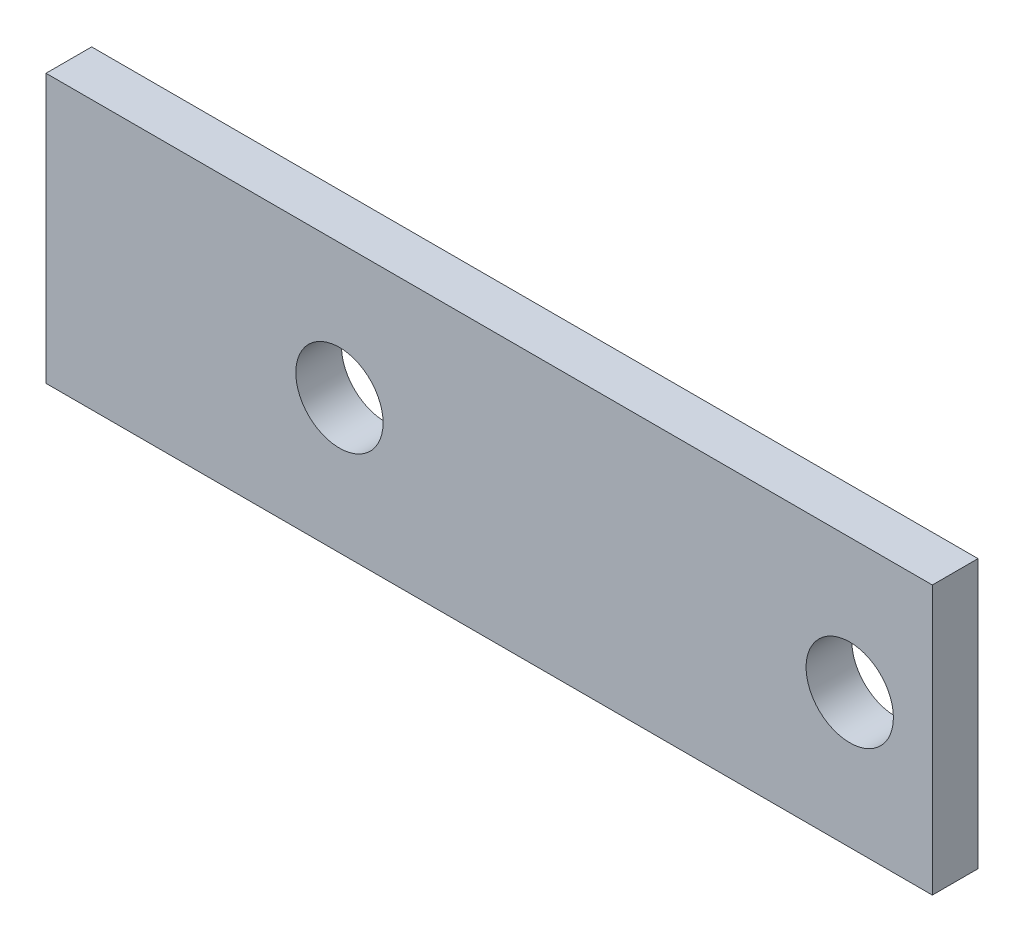
ISO-10303-21;
HEADER;
FILE_DESCRIPTION(('STEP AP214'),'2;1');
FILE_NAME('part.step','',(''),(''),'','','');
FILE_SCHEMA(('AUTOMOTIVE_DESIGN { 1 0 10303 214 1 1 1 1 }'));
ENDSEC;
DATA;
#1=APPLICATION_CONTEXT('core data for automotive mechanical design processes');
#2=APPLICATION_PROTOCOL_DEFINITION('international standard','automotive_design',2000,#1);
#3=PRODUCT_CONTEXT('',#1,'mechanical');
#4=PRODUCT('Part','Part','',(#3));
#5=PRODUCT_RELATED_PRODUCT_CATEGORY('part','',(#4));
#6=PRODUCT_DEFINITION_FORMATION('','',#4);
#7=PRODUCT_DEFINITION_CONTEXT('part definition',#1,'design');
#8=PRODUCT_DEFINITION('design','',#6,#7);
#9=PRODUCT_DEFINITION_SHAPE('','',#8);
#10=(LENGTH_UNIT() NAMED_UNIT(*) SI_UNIT(.MILLI.,.METRE.));
#11=(NAMED_UNIT(*) PLANE_ANGLE_UNIT() SI_UNIT($,.RADIAN.));
#12=(NAMED_UNIT(*) SI_UNIT($,.STERADIAN.) SOLID_ANGLE_UNIT());
#13=UNCERTAINTY_MEASURE_WITH_UNIT(LENGTH_MEASURE(1.E-05),#10,'distance_accuracy_value','');
#14=(GEOMETRIC_REPRESENTATION_CONTEXT(3) GLOBAL_UNCERTAINTY_ASSIGNED_CONTEXT((#13)) GLOBAL_UNIT_ASSIGNED_CONTEXT((#10,
#11,#12)) REPRESENTATION_CONTEXT('',''));
#15=CARTESIAN_POINT('',(0.,0.,0.));
#16=DIRECTION('',(0.,0.,1.));
#17=DIRECTION('',(1.,0.,0.));
#18=AXIS2_PLACEMENT_3D('',#15,#16,#17);
#19=CARTESIAN_POINT('',(16.5,5.,1.7));
#20=DIRECTION('',(-1.,0.,0.));
#21=DIRECTION('',(0.,0.,1.));
#22=AXIS2_PLACEMENT_3D('',#19,#20,#21);
#23=PLANE('',#22);
#24=DIRECTION('',(0.,1.,0.));
#25=VECTOR('',#24,1.);
#26=CARTESIAN_POINT('',(16.5,5.,0.));
#27=LINE('',#26,#25);
#28=CARTESIAN_POINT('',(16.5,-5.,0.));
#29=VERTEX_POINT('',#28);
#30=CARTESIAN_POINT('',(16.5,5.,0.));
#31=VERTEX_POINT('',#30);
#32=EDGE_CURVE('E97',#29,#31,#27,.T.);
#33=ORIENTED_EDGE('',*,*,#32,.T.);
#34=DIRECTION('',(0.,0.,-1.));
#35=VECTOR('',#34,1.);
#36=CARTESIAN_POINT('',(16.5,5.,1.7));
#37=LINE('',#36,#35);
#38=CARTESIAN_POINT('',(16.5,5.,1.7));
#39=VERTEX_POINT('',#38);
#40=EDGE_CURVE('E11',#39,#31,#37,.T.);
#41=ORIENTED_EDGE('',*,*,#40,.F.);
#42=DIRECTION('',(0.,1.,0.));
#43=VECTOR('',#42,1.);
#44=CARTESIAN_POINT('',(16.5,5.,1.7));
#45=LINE('',#44,#43);
#46=CARTESIAN_POINT('',(16.5,-5.,1.7));
#47=VERTEX_POINT('',#46);
#48=EDGE_CURVE('E85',#47,#39,#45,.T.);
#49=ORIENTED_EDGE('',*,*,#48,.F.);
#50=DIRECTION('',(0.,0.,-1.));
#51=VECTOR('',#50,1.);
#52=CARTESIAN_POINT('',(16.5,-5.,1.7));
#53=LINE('',#52,#51);
#54=EDGE_CURVE('E93',#47,#29,#53,.T.);
#55=ORIENTED_EDGE('',*,*,#54,.T.);
#56=EDGE_LOOP('',(#33,#41,#49,#55));
#57=FACE_BOUND('',#56,.T.);
#58=ADVANCED_FACE('F34',(#57),#23,.F.);
#59=CARTESIAN_POINT('',(-16.5,5.,1.7));
#60=DIRECTION('',(0.,-1.,0.));
#61=DIRECTION('',(0.,0.,-1.));
#62=AXIS2_PLACEMENT_3D('',#59,#60,#61);
#63=PLANE('',#62);
#64=DIRECTION('',(-1.,0.,0.));
#65=VECTOR('',#64,1.);
#66=CARTESIAN_POINT('',(-16.5,5.,0.));
#67=LINE('',#66,#65);
#68=CARTESIAN_POINT('',(-16.5,5.,0.));
#69=VERTEX_POINT('',#68);
#70=EDGE_CURVE('E89',#31,#69,#67,.T.);
#71=ORIENTED_EDGE('',*,*,#70,.T.);
#72=DIRECTION('',(0.,0.,-1.));
#73=VECTOR('',#72,1.);
#74=CARTESIAN_POINT('',(-16.5,5.,1.7));
#75=LINE('',#74,#73);
#76=CARTESIAN_POINT('',(-16.5,5.,1.7));
#77=VERTEX_POINT('',#76);
#78=EDGE_CURVE('E42',#77,#69,#75,.T.);
#79=ORIENTED_EDGE('',*,*,#78,.F.);
#80=DIRECTION('',(-1.,0.,0.));
#81=VECTOR('',#80,1.);
#82=CARTESIAN_POINT('',(-16.5,5.,1.7));
#83=LINE('',#82,#81);
#84=EDGE_CURVE('E80',#39,#77,#83,.T.);
#85=ORIENTED_EDGE('',*,*,#84,.F.);
#86=ORIENTED_EDGE('',*,*,#40,.T.);
#87=EDGE_LOOP('',(#71,#79,#85,#86));
#88=FACE_BOUND('',#87,.T.);
#89=ADVANCED_FACE('F88',(#88),#63,.F.);
#90=CARTESIAN_POINT('',(-16.5,5.,1.7));
#91=DIRECTION('',(1.,0.,0.));
#92=DIRECTION('',(0.,0.,-1.));
#93=AXIS2_PLACEMENT_3D('',#90,#91,#92);
#94=PLANE('',#93);
#95=DIRECTION('',(0.,-1.,0.));
#96=VECTOR('',#95,1.);
#97=CARTESIAN_POINT('',(-16.5,5.,0.));
#98=LINE('',#97,#96);
#99=CARTESIAN_POINT('',(-16.5,-5.,0.));
#100=VERTEX_POINT('',#99);
#101=EDGE_CURVE('E67',#69,#100,#98,.T.);
#102=ORIENTED_EDGE('',*,*,#101,.T.);
#103=DIRECTION('',(0.,0.,-1.));
#104=VECTOR('',#103,1.);
#105=CARTESIAN_POINT('',(-16.5,-5.,1.7));
#106=LINE('',#105,#104);
#107=CARTESIAN_POINT('',(-16.5,-5.,1.7));
#108=VERTEX_POINT('',#107);
#109=EDGE_CURVE('E90',#108,#100,#106,.T.);
#110=ORIENTED_EDGE('',*,*,#109,.F.);
#111=DIRECTION('',(0.,-1.,0.));
#112=VECTOR('',#111,1.);
#113=CARTESIAN_POINT('',(-16.5,5.,1.7));
#114=LINE('',#113,#112);
#115=EDGE_CURVE('E83',#77,#108,#114,.T.);
#116=ORIENTED_EDGE('',*,*,#115,.F.);
#117=ORIENTED_EDGE('',*,*,#78,.T.);
#118=EDGE_LOOP('',(#102,#110,#116,#117));
#119=FACE_BOUND('',#118,.T.);
#120=ADVANCED_FACE('F91',(#119),#94,.F.);
#121=CARTESIAN_POINT('',(-16.5,-5.,1.7));
#122=DIRECTION('',(0.,1.,0.));
#123=DIRECTION('',(0.,0.,1.));
#124=AXIS2_PLACEMENT_3D('',#121,#122,#123);
#125=PLANE('',#124);
#126=DIRECTION('',(1.,0.,0.));
#127=VECTOR('',#126,1.);
#128=CARTESIAN_POINT('',(-16.5,-5.,0.));
#129=LINE('',#128,#127);
#130=EDGE_CURVE('E73',#100,#29,#129,.T.);
#131=ORIENTED_EDGE('',*,*,#130,.T.);
#132=ORIENTED_EDGE('',*,*,#54,.F.);
#133=DIRECTION('',(1.,0.,0.));
#134=VECTOR('',#133,1.);
#135=CARTESIAN_POINT('',(-16.5,-5.,1.7));
#136=LINE('',#135,#134);
#137=EDGE_CURVE('E50',#108,#47,#136,.T.);
#138=ORIENTED_EDGE('',*,*,#137,.F.);
#139=ORIENTED_EDGE('',*,*,#109,.T.);
#140=EDGE_LOOP('',(#131,#132,#138,#139));
#141=FACE_BOUND('',#140,.T.);
#142=ADVANCED_FACE('F105',(#141),#125,.F.);
#143=CARTESIAN_POINT('',(0.,0.,1.7));
#144=DIRECTION('',(0.,0.,1.));
#145=DIRECTION('',(1.,0.,0.));
#146=AXIS2_PLACEMENT_3D('',#143,#144,#145);
#147=PLANE('',#146);
#148=CARTESIAN_POINT('',(13.425,0.,1.7));
#149=DIRECTION('',(0.,0.,1.));
#150=DIRECTION('',(1.,0.,0.));
#151=AXIS2_PLACEMENT_3D('',#148,#149,#150);
#152=CIRCLE('',#151,1.625);
#153=CARTESIAN_POINT('',(15.05,0.,1.7));
#154=VERTEX_POINT('',#153);
#155=EDGE_CURVE('E114',#154,#154,#152,.T.);
#156=ORIENTED_EDGE('',*,*,#155,.F.);
#157=EDGE_LOOP('',(#156));
#158=FACE_BOUND('',#157,.T.);
#159=CARTESIAN_POINT('',(-5.575,0.,1.7));
#160=DIRECTION('',(0.,0.,1.));
#161=DIRECTION('',(1.,0.,0.));
#162=AXIS2_PLACEMENT_3D('',#159,#160,#161);
#163=CIRCLE('',#162,1.625);
#164=CARTESIAN_POINT('',(-3.95,0.,1.7));
#165=VERTEX_POINT('',#164);
#166=EDGE_CURVE('E115',#165,#165,#163,.T.);
#167=ORIENTED_EDGE('',*,*,#166,.F.);
#168=EDGE_LOOP('',(#167));
#169=FACE_BOUND('',#168,.T.);
#170=ORIENTED_EDGE('',*,*,#48,.T.);
#171=ORIENTED_EDGE('',*,*,#84,.T.);
#172=ORIENTED_EDGE('',*,*,#115,.T.);
#173=ORIENTED_EDGE('',*,*,#137,.T.);
#174=EDGE_LOOP('',(#170,#171,#172,#173));
#175=FACE_BOUND('',#174,.T.);
#176=ADVANCED_FACE('F81',(#158,#169,#175),#147,.T.);
#177=CARTESIAN_POINT('',(0.,0.,0.));
#178=DIRECTION('',(0.,0.,1.));
#179=DIRECTION('',(1.,0.,0.));
#180=AXIS2_PLACEMENT_3D('',#177,#178,#179);
#181=PLANE('',#180);
#182=CARTESIAN_POINT('',(13.425,0.,0.));
#183=DIRECTION('',(0.,0.,1.));
#184=DIRECTION('',(1.,0.,0.));
#185=AXIS2_PLACEMENT_3D('',#182,#183,#184);
#186=CIRCLE('',#185,1.625);
#187=CARTESIAN_POINT('',(15.05,0.,0.));
#188=VERTEX_POINT('',#187);
#189=EDGE_CURVE('E100',#188,#188,#186,.F.);
#190=ORIENTED_EDGE('',*,*,#189,.F.);
#191=EDGE_LOOP('',(#190));
#192=FACE_BOUND('',#191,.T.);
#193=CARTESIAN_POINT('',(-5.575,0.,0.));
#194=DIRECTION('',(0.,0.,1.));
#195=DIRECTION('',(1.,0.,0.));
#196=AXIS2_PLACEMENT_3D('',#193,#194,#195);
#197=CIRCLE('',#196,1.625);
#198=CARTESIAN_POINT('',(-3.95,0.,0.));
#199=VERTEX_POINT('',#198);
#200=EDGE_CURVE('E111',#199,#199,#197,.F.);
#201=ORIENTED_EDGE('',*,*,#200,.F.);
#202=EDGE_LOOP('',(#201));
#203=FACE_BOUND('',#202,.T.);
#204=ORIENTED_EDGE('',*,*,#32,.F.);
#205=ORIENTED_EDGE('',*,*,#130,.F.);
#206=ORIENTED_EDGE('',*,*,#101,.F.);
#207=ORIENTED_EDGE('',*,*,#70,.F.);
#208=EDGE_LOOP('',(#204,#205,#206,#207));
#209=FACE_BOUND('',#208,.T.);
#210=ADVANCED_FACE('F108',(#192,#203,#209),#181,.F.);
#211=CARTESIAN_POINT('',(-5.575,0.,-4.59619407771256));
#212=DIRECTION('',(0.,0.,1.));
#213=DIRECTION('',(1.,0.,0.));
#214=AXIS2_PLACEMENT_3D('',#211,#212,#213);
#215=CYLINDRICAL_SURFACE('',#214,1.625);
#216=ORIENTED_EDGE('',*,*,#200,.T.);
#217=EDGE_LOOP('',(#216));
#218=FACE_BOUND('',#217,.T.);
#219=ORIENTED_EDGE('',*,*,#166,.T.);
#220=EDGE_LOOP('',(#219));
#221=FACE_BOUND('',#220,.T.);
#222=ADVANCED_FACE('F130',(#218,#221),#215,.F.);
#223=CARTESIAN_POINT('',(13.425,0.,-4.59619407771256));
#224=DIRECTION('',(0.,0.,1.));
#225=DIRECTION('',(1.,0.,0.));
#226=AXIS2_PLACEMENT_3D('',#223,#224,#225);
#227=CYLINDRICAL_SURFACE('',#226,1.625);
#228=ORIENTED_EDGE('',*,*,#189,.T.);
#229=EDGE_LOOP('',(#228));
#230=FACE_BOUND('',#229,.T.);
#231=ORIENTED_EDGE('',*,*,#155,.T.);
#232=EDGE_LOOP('',(#231));
#233=FACE_BOUND('',#232,.T.);
#234=ADVANCED_FACE('F123',(#230,#233),#227,.F.);
#235=CLOSED_SHELL('',(#58,#89,#120,#142,#176,#210,#222,#234));
#236=MANIFOLD_SOLID_BREP('B2',#235);
#237=ADVANCED_BREP_SHAPE_REPRESENTATION('',(#18,#236),#14);
#238=SHAPE_DEFINITION_REPRESENTATION(#9,#237);
ENDSEC;
END-ISO-10303-21;
